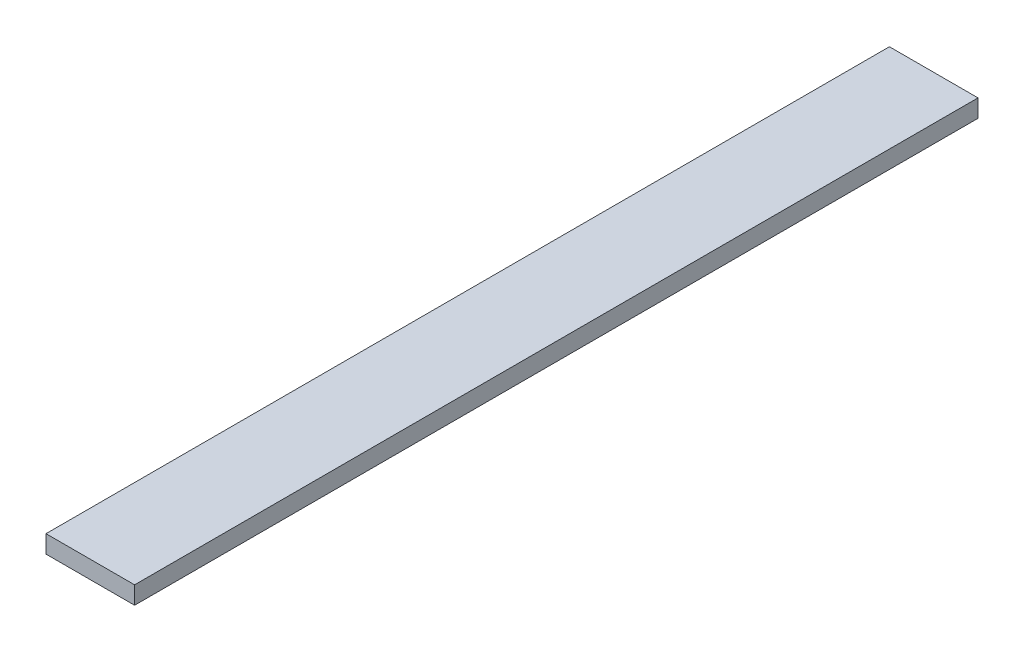
ISO-10303-21;
HEADER;
FILE_DESCRIPTION(('STEP AP214'),'2;1');
FILE_NAME('part.step','',(''),(''),'','','');
FILE_SCHEMA(('AUTOMOTIVE_DESIGN { 1 0 10303 214 1 1 1 1 }'));
ENDSEC;
DATA;
#1=APPLICATION_CONTEXT('core data for automotive mechanical design processes');
#2=APPLICATION_PROTOCOL_DEFINITION('international standard','automotive_design',2000,#1);
#3=PRODUCT_CONTEXT('',#1,'mechanical');
#4=PRODUCT('Part','Part','',(#3));
#5=PRODUCT_RELATED_PRODUCT_CATEGORY('part','',(#4));
#6=PRODUCT_DEFINITION_FORMATION('','',#4);
#7=PRODUCT_DEFINITION_CONTEXT('part definition',#1,'design');
#8=PRODUCT_DEFINITION('design','',#6,#7);
#9=PRODUCT_DEFINITION_SHAPE('','',#8);
#10=(LENGTH_UNIT() NAMED_UNIT(*) SI_UNIT(.MILLI.,.METRE.));
#11=(NAMED_UNIT(*) PLANE_ANGLE_UNIT() SI_UNIT($,.RADIAN.));
#12=(NAMED_UNIT(*) SI_UNIT($,.STERADIAN.) SOLID_ANGLE_UNIT());
#13=UNCERTAINTY_MEASURE_WITH_UNIT(LENGTH_MEASURE(1.E-05),#10,'distance_accuracy_value','');
#14=(GEOMETRIC_REPRESENTATION_CONTEXT(3) GLOBAL_UNCERTAINTY_ASSIGNED_CONTEXT((#13)) GLOBAL_UNIT_ASSIGNED_CONTEXT((#10,
#11,#12)) REPRESENTATION_CONTEXT('',''));
#15=CARTESIAN_POINT('',(0.,0.,0.));
#16=DIRECTION('',(0.,0.,1.));
#17=DIRECTION('',(1.,0.,0.));
#18=AXIS2_PLACEMENT_3D('',#15,#16,#17);
#19=CARTESIAN_POINT('',(0.,1.42999999999,0.));
#20=DIRECTION('',(0.,-1.,0.));
#21=DIRECTION('',(1.,0.,0.));
#22=AXIS2_PLACEMENT_3D('',#19,#20,#21);
#23=PLANE('',#22);
#24=DIRECTION('',(0.,0.,1.));
#25=VECTOR('',#24,1.);
#26=CARTESIAN_POINT('',(1.125,1.42999999999,0.195));
#27=LINE('',#26,#25);
#28=CARTESIAN_POINT('',(1.125,1.42999999999,0.195));
#29=VERTEX_POINT('',#28);
#30=CARTESIAN_POINT('',(1.125,1.42999999999,2.575));
#31=VERTEX_POINT('',#30);
#32=EDGE_CURVE('E80',#29,#31,#27,.T.);
#33=ORIENTED_EDGE('',*,*,#32,.T.);
#34=DIRECTION('',(-1.,0.,0.));
#35=VECTOR('',#34,1.);
#36=CARTESIAN_POINT('',(1.375,1.42999999999,2.575));
#37=LINE('',#36,#35);
#38=CARTESIAN_POINT('',(1.375,1.42999999999,2.575));
#39=VERTEX_POINT('',#38);
#40=EDGE_CURVE('E67',#31,#39,#37,.F.);
#41=ORIENTED_EDGE('',*,*,#40,.T.);
#42=DIRECTION('',(0.,0.,1.));
#43=VECTOR('',#42,1.);
#44=CARTESIAN_POINT('',(1.375,1.42999999999,0.195));
#45=LINE('',#44,#43);
#46=CARTESIAN_POINT('',(1.375,1.42999999999,0.195));
#47=VERTEX_POINT('',#46);
#48=EDGE_CURVE('E54',#39,#47,#45,.F.);
#49=ORIENTED_EDGE('',*,*,#48,.T.);
#50=DIRECTION('',(1.,0.,0.));
#51=VECTOR('',#50,1.);
#52=CARTESIAN_POINT('',(1.375,1.42999999999,0.195));
#53=LINE('',#52,#51);
#54=EDGE_CURVE('E19',#47,#29,#53,.F.);
#55=ORIENTED_EDGE('',*,*,#54,.T.);
#56=EDGE_LOOP('',(#33,#41,#49,#55));
#57=FACE_BOUND('',#56,.T.);
#58=ADVANCED_FACE('F16',(#57),#23,.F.);
#59=CARTESIAN_POINT('',(1.375,1.37999999999,0.195));
#60=DIRECTION('',(0.,0.,1.));
#61=DIRECTION('',(1.,0.,0.));
#62=AXIS2_PLACEMENT_3D('',#59,#60,#61);
#63=PLANE('',#62);
#64=DIRECTION('',(0.,-1.,0.));
#65=VECTOR('',#64,1.);
#66=CARTESIAN_POINT('',(1.375,1.37999999999,0.195));
#67=LINE('',#66,#65);
#68=CARTESIAN_POINT('',(1.375,1.37999999999,0.195));
#69=VERTEX_POINT('',#68);
#70=EDGE_CURVE('E60',#47,#69,#67,.T.);
#71=ORIENTED_EDGE('',*,*,#70,.T.);
#72=DIRECTION('',(1.,0.,0.));
#73=VECTOR('',#72,1.);
#74=CARTESIAN_POINT('',(0.,1.37999999999,0.195));
#75=LINE('',#74,#73);
#76=CARTESIAN_POINT('',(1.125,1.37999999999,0.195));
#77=VERTEX_POINT('',#76);
#78=EDGE_CURVE('E82',#77,#69,#75,.T.);
#79=ORIENTED_EDGE('',*,*,#78,.F.);
#80=DIRECTION('',(0.,1.,0.));
#81=VECTOR('',#80,1.);
#82=CARTESIAN_POINT('',(1.125,1.37999999999,0.195));
#83=LINE('',#82,#81);
#84=EDGE_CURVE('E63',#77,#29,#83,.T.);
#85=ORIENTED_EDGE('',*,*,#84,.T.);
#86=ORIENTED_EDGE('',*,*,#54,.F.);
#87=EDGE_LOOP('',(#71,#79,#85,#86));
#88=FACE_BOUND('',#87,.T.);
#89=ADVANCED_FACE('F59',(#88),#63,.F.);
#90=CARTESIAN_POINT('',(1.375,1.37999999999,0.195));
#91=DIRECTION('',(-1.,0.,0.));
#92=DIRECTION('',(0.,-1.,0.));
#93=AXIS2_PLACEMENT_3D('',#90,#91,#92);
#94=PLANE('',#93);
#95=DIRECTION('',(0.,1.,0.));
#96=VECTOR('',#95,1.);
#97=CARTESIAN_POINT('',(1.375,1.37999999999,2.575));
#98=LINE('',#97,#96);
#99=CARTESIAN_POINT('',(1.375,1.37999999999,2.575));
#100=VERTEX_POINT('',#99);
#101=EDGE_CURVE('E69',#39,#100,#98,.F.);
#102=ORIENTED_EDGE('',*,*,#101,.T.);
#103=DIRECTION('',(0.,0.,1.));
#104=VECTOR('',#103,1.);
#105=CARTESIAN_POINT('',(1.375,1.37999999999,0.));
#106=LINE('',#105,#104);
#107=EDGE_CURVE('E73',#69,#100,#106,.T.);
#108=ORIENTED_EDGE('',*,*,#107,.F.);
#109=ORIENTED_EDGE('',*,*,#70,.F.);
#110=ORIENTED_EDGE('',*,*,#48,.F.);
#111=EDGE_LOOP('',(#102,#108,#109,#110));
#112=FACE_BOUND('',#111,.T.);
#113=ADVANCED_FACE('F71',(#112),#94,.F.);
#114=CARTESIAN_POINT('',(1.375,1.37999999999,2.575));
#115=DIRECTION('',(0.,0.,-1.));
#116=DIRECTION('',(-1.,0.,0.));
#117=AXIS2_PLACEMENT_3D('',#114,#115,#116);
#118=PLANE('',#117);
#119=DIRECTION('',(0.,1.,0.));
#120=VECTOR('',#119,1.);
#121=CARTESIAN_POINT('',(1.125,1.37999999999,2.575));
#122=LINE('',#121,#120);
#123=CARTESIAN_POINT('',(1.125,1.37999999999,2.575));
#124=VERTEX_POINT('',#123);
#125=EDGE_CURVE('E34',#31,#124,#122,.F.);
#126=ORIENTED_EDGE('',*,*,#125,.T.);
#127=DIRECTION('',(1.,0.,0.));
#128=VECTOR('',#127,1.);
#129=CARTESIAN_POINT('',(0.,1.37999999999,2.575));
#130=LINE('',#129,#128);
#131=EDGE_CURVE('E25',#100,#124,#130,.F.);
#132=ORIENTED_EDGE('',*,*,#131,.F.);
#133=ORIENTED_EDGE('',*,*,#101,.F.);
#134=ORIENTED_EDGE('',*,*,#40,.F.);
#135=EDGE_LOOP('',(#126,#132,#133,#134));
#136=FACE_BOUND('',#135,.T.);
#137=ADVANCED_FACE('F88',(#136),#118,.F.);
#138=CARTESIAN_POINT('',(1.125,1.37999999999,0.195));
#139=DIRECTION('',(1.,0.,0.));
#140=DIRECTION('',(0.,1.,0.));
#141=AXIS2_PLACEMENT_3D('',#138,#139,#140);
#142=PLANE('',#141);
#143=ORIENTED_EDGE('',*,*,#84,.F.);
#144=DIRECTION('',(0.,0.,1.));
#145=VECTOR('',#144,1.);
#146=CARTESIAN_POINT('',(1.125,1.37999999999,0.));
#147=LINE('',#146,#145);
#148=EDGE_CURVE('E11',#124,#77,#147,.F.);
#149=ORIENTED_EDGE('',*,*,#148,.F.);
#150=ORIENTED_EDGE('',*,*,#125,.F.);
#151=ORIENTED_EDGE('',*,*,#32,.F.);
#152=EDGE_LOOP('',(#143,#149,#150,#151));
#153=FACE_BOUND('',#152,.T.);
#154=ADVANCED_FACE('F90',(#153),#142,.F.);
#155=CARTESIAN_POINT('',(0.,1.37999999999,0.));
#156=DIRECTION('',(0.,-1.,0.));
#157=DIRECTION('',(1.,0.,0.));
#158=AXIS2_PLACEMENT_3D('',#155,#156,#157);
#159=PLANE('',#158);
#160=ORIENTED_EDGE('',*,*,#131,.T.);
#161=ORIENTED_EDGE('',*,*,#148,.T.);
#162=ORIENTED_EDGE('',*,*,#78,.T.);
#163=ORIENTED_EDGE('',*,*,#107,.T.);
#164=EDGE_LOOP('',(#160,#161,#162,#163));
#165=FACE_BOUND('',#164,.T.);
#166=ADVANCED_FACE('F87',(#165),#159,.T.);
#167=CLOSED_SHELL('',(#58,#89,#113,#137,#154,#166));
#168=MANIFOLD_SOLID_BREP('B1',#167);
#169=ADVANCED_BREP_SHAPE_REPRESENTATION('',(#18,#168),#14);
#170=SHAPE_DEFINITION_REPRESENTATION(#9,#169);
ENDSEC;
END-ISO-10303-21;
